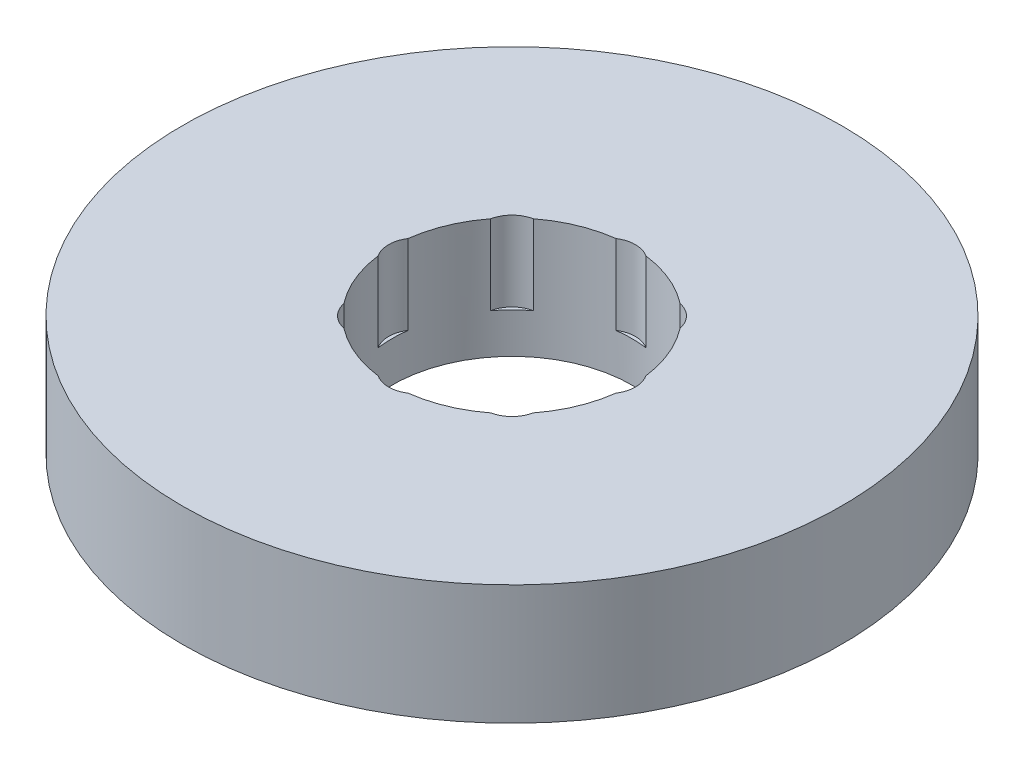
ISO-10303-21;
HEADER;
FILE_DESCRIPTION(('STEP AP214'),'2;1');
FILE_NAME('part.step','',(''),(''),'','','');
FILE_SCHEMA(('AUTOMOTIVE_DESIGN { 1 0 10303 214 1 1 1 1 }'));
ENDSEC;
DATA;
#1=APPLICATION_CONTEXT('core data for automotive mechanical design processes');
#2=APPLICATION_PROTOCOL_DEFINITION('international standard','automotive_design',2000,#1);
#3=PRODUCT_CONTEXT('',#1,'mechanical');
#4=PRODUCT('Part','Part','',(#3));
#5=PRODUCT_RELATED_PRODUCT_CATEGORY('part','',(#4));
#6=PRODUCT_DEFINITION_FORMATION('','',#4);
#7=PRODUCT_DEFINITION_CONTEXT('part definition',#1,'design');
#8=PRODUCT_DEFINITION('design','',#6,#7);
#9=PRODUCT_DEFINITION_SHAPE('','',#8);
#10=(LENGTH_UNIT() NAMED_UNIT(*) SI_UNIT(.MILLI.,.METRE.));
#11=(NAMED_UNIT(*) PLANE_ANGLE_UNIT() SI_UNIT($,.RADIAN.));
#12=(NAMED_UNIT(*) SI_UNIT($,.STERADIAN.) SOLID_ANGLE_UNIT());
#13=UNCERTAINTY_MEASURE_WITH_UNIT(LENGTH_MEASURE(1.E-05),#10,'distance_accuracy_value','');
#14=(GEOMETRIC_REPRESENTATION_CONTEXT(3) GLOBAL_UNCERTAINTY_ASSIGNED_CONTEXT((#13)) GLOBAL_UNIT_ASSIGNED_CONTEXT((#10,
#11,#12)) REPRESENTATION_CONTEXT('',''));
#15=CARTESIAN_POINT('',(0.,0.,0.));
#16=DIRECTION('',(0.,0.,1.));
#17=DIRECTION('',(1.,0.,0.));
#18=AXIS2_PLACEMENT_3D('',#15,#16,#17);
#19=CARTESIAN_POINT('',(0.,30.,0.));
#20=DIRECTION('',(0.,-1.,0.));
#21=DIRECTION('',(0.,0.,-1.));
#22=AXIS2_PLACEMENT_3D('',#19,#20,#21);
#23=CYLINDRICAL_SURFACE('',#22,82.5);
#24=CARTESIAN_POINT('',(0.,30.,0.));
#25=DIRECTION('',(0.,1.,0.));
#26=DIRECTION('',(0.,0.,1.));
#27=AXIS2_PLACEMENT_3D('',#24,#25,#26);
#28=CIRCLE('',#27,82.5);
#29=CARTESIAN_POINT('',(0.,30.,82.5));
#30=VERTEX_POINT('',#29);
#31=EDGE_CURVE('E183',#30,#30,#28,.T.);
#32=ORIENTED_EDGE('',*,*,#31,.F.);
#33=EDGE_LOOP('',(#32));
#34=FACE_BOUND('',#33,.T.);
#35=CARTESIAN_POINT('',(0.,0.,0.));
#36=DIRECTION('',(0.,1.,0.));
#37=DIRECTION('',(0.,0.,1.));
#38=AXIS2_PLACEMENT_3D('',#35,#36,#37);
#39=CIRCLE('',#38,82.5);
#40=CARTESIAN_POINT('',(0.,0.,82.5));
#41=VERTEX_POINT('',#40);
#42=EDGE_CURVE('E182',#41,#41,#39,.T.);
#43=ORIENTED_EDGE('',*,*,#42,.T.);
#44=EDGE_LOOP('',(#43));
#45=FACE_BOUND('',#44,.T.);
#46=ADVANCED_FACE('F39',(#34,#45),#23,.T.);
#47=CARTESIAN_POINT('',(0.,30.,0.));
#48=DIRECTION('',(0.,1.,0.));
#49=DIRECTION('',(0.,0.,1.));
#50=AXIS2_PLACEMENT_3D('',#47,#48,#49);
#51=PLANE('',#50);
#52=CARTESIAN_POINT('',(0.,30.,23.9976735900293));
#53=DIRECTION('',(0.,1.,0.));
#54=DIRECTION('',(1.,0.,0.));
#55=AXIS2_PLACEMENT_3D('',#52,#53,#54);
#56=CIRCLE('',#55,6.8860388837222);
#57=CARTESIAN_POINT('',(-3.7659098851479,30.,29.7626934724824));
#58=VERTEX_POINT('',#57);
#59=CARTESIAN_POINT('',(3.76590988514811,30.,29.7626934724824));
#60=VERTEX_POINT('',#59);
#61=EDGE_CURVE('E256',#58,#60,#56,.T.);
#62=ORIENTED_EDGE('',*,*,#61,.F.);
#63=CARTESIAN_POINT('',(0.,30.,0.));
#64=DIRECTION('',(0.,1.,0.));
#65=DIRECTION('',(0.,0.,1.));
#66=AXIS2_PLACEMENT_3D('',#63,#64,#65);
#67=CIRCLE('',#66,30.);
#68=CARTESIAN_POINT('',(-18.3825019636432,30.,23.7083027978945));
#69=VERTEX_POINT('',#68);
#70=EDGE_CURVE('E175',#69,#58,#67,.T.);
#71=ORIENTED_EDGE('',*,*,#70,.F.);
#72=CARTESIAN_POINT('',(-16.968917728211,30.,16.9689177282111));
#73=DIRECTION('',(0.,1.,0.));
#74=DIRECTION('',(0.707106781186549,0.,0.707106781186546));
#75=AXIS2_PLACEMENT_3D('',#72,#73,#74);
#76=CIRCLE('',#75,6.8860388837222);
#77=CARTESIAN_POINT('',(-23.7083027978945,30.,18.3825019636433));
#78=VERTEX_POINT('',#77);
#79=EDGE_CURVE('E152',#78,#69,#76,.T.);
#80=ORIENTED_EDGE('',*,*,#79,.F.);
#81=CARTESIAN_POINT('',(-29.7626934724824,30.,3.76590988514801));
#82=VERTEX_POINT('',#81);
#83=EDGE_CURVE('E168',#82,#78,#67,.T.);
#84=ORIENTED_EDGE('',*,*,#83,.F.);
#85=CARTESIAN_POINT('',(-23.9976735900293,30.,0.));
#86=DIRECTION('',(0.,1.,0.));
#87=DIRECTION('',(0.,0.,1.));
#88=AXIS2_PLACEMENT_3D('',#85,#86,#87);
#89=CIRCLE('',#88,6.8860388837222);
#90=CARTESIAN_POINT('',(-29.7626934724824,30.,-3.76590988514801));
#91=VERTEX_POINT('',#90);
#92=EDGE_CURVE('E205',#91,#82,#89,.T.);
#93=ORIENTED_EDGE('',*,*,#92,.F.);
#94=CARTESIAN_POINT('',(-23.7083027978947,30.,-18.382501963643));
#95=VERTEX_POINT('',#94);
#96=EDGE_CURVE('E181',#95,#91,#67,.T.);
#97=ORIENTED_EDGE('',*,*,#96,.F.);
#98=CARTESIAN_POINT('',(-16.9689177282113,30.,-16.9689177282109));
#99=DIRECTION('',(0.,1.,0.));
#100=DIRECTION('',(-0.707106781186539,0.,0.707106781186556));
#101=AXIS2_PLACEMENT_3D('',#98,#99,#100);
#102=CIRCLE('',#101,6.8860388837222);
#103=CARTESIAN_POINT('',(-18.3825019636436,30.,-23.7083027978943));
#104=VERTEX_POINT('',#103);
#105=EDGE_CURVE('E453',#104,#95,#102,.T.);
#106=ORIENTED_EDGE('',*,*,#105,.F.);
#107=CARTESIAN_POINT('',(-3.76590988514832,30.,-29.7626934724823));
#108=VERTEX_POINT('',#107);
#109=EDGE_CURVE('E189',#108,#104,#67,.T.);
#110=ORIENTED_EDGE('',*,*,#109,.F.);
#111=CARTESIAN_POINT('',(-2.51362288545708E-13,30.,-23.9976735900293));
#112=DIRECTION('',(0.,1.,0.));
#113=DIRECTION('',(-1.,0.,0.));
#114=AXIS2_PLACEMENT_3D('',#111,#112,#113);
#115=CIRCLE('',#114,6.8860388837222);
#116=CARTESIAN_POINT('',(3.76590988514769,30.,-29.7626934724824));
#117=VERTEX_POINT('',#116);
#118=EDGE_CURVE('E462',#117,#108,#115,.T.);
#119=ORIENTED_EDGE('',*,*,#118,.F.);
#120=CARTESIAN_POINT('',(18.3825019636431,30.,-23.7083027978946));
#121=VERTEX_POINT('',#120);
#122=EDGE_CURVE('E197',#121,#117,#67,.T.);
#123=ORIENTED_EDGE('',*,*,#122,.F.);
#124=CARTESIAN_POINT('',(16.9689177282109,30.,-16.9689177282112));
#125=DIRECTION('',(0.,1.,0.));
#126=DIRECTION('',(-0.707106781186554,0.,-0.707106781186541));
#127=AXIS2_PLACEMENT_3D('',#124,#125,#126);
#128=CIRCLE('',#127,6.8860388837222);
#129=CARTESIAN_POINT('',(23.7083027978943,30.,-18.3825019636435));
#130=VERTEX_POINT('',#129);
#131=EDGE_CURVE('E470',#130,#121,#128,.T.);
#132=ORIENTED_EDGE('',*,*,#131,.F.);
#133=CARTESIAN_POINT('',(29.7626934724824,30.,-3.76590988514801));
#134=VERTEX_POINT('',#133);
#135=EDGE_CURVE('E489',#134,#130,#67,.T.);
#136=ORIENTED_EDGE('',*,*,#135,.F.);
#137=CARTESIAN_POINT('',(23.9976735900293,30.,0.));
#138=DIRECTION('',(0.,1.,0.));
#139=DIRECTION('',(0.,0.,-1.));
#140=AXIS2_PLACEMENT_3D('',#137,#138,#139);
#141=CIRCLE('',#140,6.8860388837222);
#142=CARTESIAN_POINT('',(29.7626934724824,30.,3.76590988514801));
#143=VERTEX_POINT('',#142);
#144=EDGE_CURVE('E476',#143,#134,#141,.T.);
#145=ORIENTED_EDGE('',*,*,#144,.F.);
#146=CARTESIAN_POINT('',(23.7083027978946,30.,18.3825019636431));
#147=VERTEX_POINT('',#146);
#148=EDGE_CURVE('E491',#147,#143,#67,.T.);
#149=ORIENTED_EDGE('',*,*,#148,.F.);
#150=CARTESIAN_POINT('',(16.9689177282112,30.,16.968917728211));
#151=DIRECTION('',(0.,1.,0.));
#152=DIRECTION('',(0.707106781186544,0.,-0.707106781186551));
#153=AXIS2_PLACEMENT_3D('',#150,#151,#152);
#154=CIRCLE('',#153,6.8860388837222);
#155=CARTESIAN_POINT('',(18.3825019636434,30.,23.7083027978944));
#156=VERTEX_POINT('',#155);
#157=EDGE_CURVE('E475',#156,#147,#154,.T.);
#158=ORIENTED_EDGE('',*,*,#157,.F.);
#159=EDGE_CURVE('E190',#60,#156,#67,.T.);
#160=ORIENTED_EDGE('',*,*,#159,.F.);
#161=EDGE_LOOP('',(#62,#71,#80,#84,#93,#97,#106,#110,#119,#123,#132,#136,#145,#149,#158,#160));
#162=FACE_BOUND('',#161,.T.);
#163=ORIENTED_EDGE('',*,*,#31,.T.);
#164=EDGE_LOOP('',(#163));
#165=FACE_BOUND('',#164,.T.);
#166=ADVANCED_FACE('F170',(#162,#165),#51,.T.);
#167=CARTESIAN_POINT('',(0.,0.,0.));
#168=DIRECTION('',(0.,1.,0.));
#169=DIRECTION('',(0.,0.,1.));
#170=AXIS2_PLACEMENT_3D('',#167,#168,#169);
#171=PLANE('',#170);
#172=CARTESIAN_POINT('',(0.,0.,0.));
#173=DIRECTION('',(0.,1.,0.));
#174=DIRECTION('',(0.,0.,1.));
#175=AXIS2_PLACEMENT_3D('',#172,#173,#174);
#176=CIRCLE('',#175,30.);
#177=CARTESIAN_POINT('',(0.,0.,30.));
#178=VERTEX_POINT('',#177);
#179=EDGE_CURVE('E191',#178,#178,#176,.T.);
#180=ORIENTED_EDGE('',*,*,#179,.T.);
#181=EDGE_LOOP('',(#180));
#182=FACE_BOUND('',#181,.T.);
#183=ORIENTED_EDGE('',*,*,#42,.F.);
#184=EDGE_LOOP('',(#183));
#185=FACE_BOUND('',#184,.T.);
#186=ADVANCED_FACE('F277',(#182,#185),#171,.F.);
#187=CARTESIAN_POINT('',(0.,30.,0.));
#188=DIRECTION('',(0.,-1.,0.));
#189=DIRECTION('',(0.,0.,-1.));
#190=AXIS2_PLACEMENT_3D('',#187,#188,#189);
#191=CYLINDRICAL_SURFACE('',#190,30.);
#192=DIRECTION('',(0.,1.,0.));
#193=VECTOR('',#192,1.);
#194=CARTESIAN_POINT('',(-3.76590988514792,20.0420408060366,29.7626934724824));
#195=LINE('',#194,#193);
#196=CARTESIAN_POINT('',(-3.7659098851479,10.0840816120733,29.7626934724824));
#197=VERTEX_POINT('',#196);
#198=EDGE_CURVE('E11',#197,#58,#195,.T.);
#199=ORIENTED_EDGE('',*,*,#198,.F.);
#200=CARTESIAN_POINT('',(0.,10.0840816120733,0.));
#201=DIRECTION('',(0.,1.,0.));
#202=DIRECTION('',(0.,0.,1.));
#203=AXIS2_PLACEMENT_3D('',#200,#201,#202);
#204=CIRCLE('',#203,30.);
#205=CARTESIAN_POINT('',(3.76590988514811,10.0840816120733,29.7626934724824));
#206=VERTEX_POINT('',#205);
#207=EDGE_CURVE('E251',#197,#206,#204,.T.);
#208=ORIENTED_EDGE('',*,*,#207,.T.);
#209=DIRECTION('',(0.,1.,0.));
#210=VECTOR('',#209,1.);
#211=CARTESIAN_POINT('',(3.76590988514812,20.0420408060366,29.7626934724823));
#212=LINE('',#211,#210);
#213=EDGE_CURVE('E46',#60,#206,#212,.F.);
#214=ORIENTED_EDGE('',*,*,#213,.F.);
#215=ORIENTED_EDGE('',*,*,#159,.T.);
#216=DIRECTION('',(0.,1.,0.));
#217=VECTOR('',#216,1.);
#218=CARTESIAN_POINT('',(18.3825019636434,20.0420408060366,23.7083027978944));
#219=LINE('',#218,#217);
#220=CARTESIAN_POINT('',(18.3825019636434,10.0840816120733,23.7083027978944));
#221=VERTEX_POINT('',#220);
#222=EDGE_CURVE('E253',#221,#156,#219,.T.);
#223=ORIENTED_EDGE('',*,*,#222,.F.);
#224=CARTESIAN_POINT('',(0.,10.0840816120733,0.));
#225=DIRECTION('',(0.,1.,0.));
#226=DIRECTION('',(0.,0.,1.));
#227=AXIS2_PLACEMENT_3D('',#224,#225,#226);
#228=CIRCLE('',#227,30.);
#229=CARTESIAN_POINT('',(23.7083027978946,10.0840816120733,18.3825019636431));
#230=VERTEX_POINT('',#229);
#231=EDGE_CURVE('E246',#221,#230,#228,.T.);
#232=ORIENTED_EDGE('',*,*,#231,.T.);
#233=DIRECTION('',(0.,1.,0.));
#234=VECTOR('',#233,1.);
#235=CARTESIAN_POINT('',(23.7083027978946,20.0420408060366,18.3825019636431));
#236=LINE('',#235,#234);
#237=EDGE_CURVE('E248',#147,#230,#236,.F.);
#238=ORIENTED_EDGE('',*,*,#237,.F.);
#239=ORIENTED_EDGE('',*,*,#148,.T.);
#240=DIRECTION('',(0.,1.,0.));
#241=VECTOR('',#240,1.);
#242=CARTESIAN_POINT('',(29.7626934724824,20.0420408060366,3.76590988514802));
#243=LINE('',#242,#241);
#244=CARTESIAN_POINT('',(29.7626934724824,10.0840816120733,3.76590988514801));
#245=VERTEX_POINT('',#244);
#246=EDGE_CURVE('E243',#245,#143,#243,.T.);
#247=ORIENTED_EDGE('',*,*,#246,.F.);
#248=CARTESIAN_POINT('',(0.,10.0840816120733,0.));
#249=DIRECTION('',(0.,1.,0.));
#250=DIRECTION('',(0.,0.,1.));
#251=AXIS2_PLACEMENT_3D('',#248,#249,#250);
#252=CIRCLE('',#251,30.);
#253=CARTESIAN_POINT('',(29.7626934724824,10.0840816120733,-3.76590988514801));
#254=VERTEX_POINT('',#253);
#255=EDGE_CURVE('E236',#245,#254,#252,.T.);
#256=ORIENTED_EDGE('',*,*,#255,.T.);
#257=DIRECTION('',(0.,1.,0.));
#258=VECTOR('',#257,1.);
#259=CARTESIAN_POINT('',(29.7626934724824,20.0420408060366,-3.76590988514802));
#260=LINE('',#259,#258);
#261=EDGE_CURVE('E241',#134,#254,#260,.F.);
#262=ORIENTED_EDGE('',*,*,#261,.F.);
#263=ORIENTED_EDGE('',*,*,#135,.T.);
#264=DIRECTION('',(0.,1.,0.));
#265=VECTOR('',#264,1.);
#266=CARTESIAN_POINT('',(23.7083027978943,20.0420408060366,-18.3825019636435));
#267=LINE('',#266,#265);
#268=CARTESIAN_POINT('',(23.7083027978943,10.0840816120733,-18.3825019636435));
#269=VERTEX_POINT('',#268);
#270=EDGE_CURVE('E237',#269,#130,#267,.T.);
#271=ORIENTED_EDGE('',*,*,#270,.F.);
#272=CARTESIAN_POINT('',(0.,10.0840816120733,0.));
#273=DIRECTION('',(0.,1.,0.));
#274=DIRECTION('',(0.,0.,1.));
#275=AXIS2_PLACEMENT_3D('',#272,#273,#274);
#276=CIRCLE('',#275,30.);
#277=CARTESIAN_POINT('',(18.3825019636431,10.0840816120733,-23.7083027978946));
#278=VERTEX_POINT('',#277);
#279=EDGE_CURVE('E229',#269,#278,#276,.T.);
#280=ORIENTED_EDGE('',*,*,#279,.T.);
#281=DIRECTION('',(0.,1.,0.));
#282=VECTOR('',#281,1.);
#283=CARTESIAN_POINT('',(18.3825019636431,20.0420408060366,-23.7083027978946));
#284=LINE('',#283,#282);
#285=EDGE_CURVE('E232',#121,#278,#284,.F.);
#286=ORIENTED_EDGE('',*,*,#285,.F.);
#287=ORIENTED_EDGE('',*,*,#122,.T.);
#288=DIRECTION('',(0.,1.,0.));
#289=VECTOR('',#288,1.);
#290=CARTESIAN_POINT('',(3.76590988514771,20.0420408060366,-29.7626934724824));
#291=LINE('',#290,#289);
#292=CARTESIAN_POINT('',(3.76590988514769,10.0840816120733,-29.7626934724824));
#293=VERTEX_POINT('',#292);
#294=EDGE_CURVE('E227',#293,#117,#291,.T.);
#295=ORIENTED_EDGE('',*,*,#294,.F.);
#296=CARTESIAN_POINT('',(0.,10.0840816120733,0.));
#297=DIRECTION('',(0.,1.,0.));
#298=DIRECTION('',(0.,0.,1.));
#299=AXIS2_PLACEMENT_3D('',#296,#297,#298);
#300=CIRCLE('',#299,30.);
#301=CARTESIAN_POINT('',(-3.76590988514832,10.0840816120733,-29.7626934724823));
#302=VERTEX_POINT('',#301);
#303=EDGE_CURVE('E225',#293,#302,#300,.T.);
#304=ORIENTED_EDGE('',*,*,#303,.T.);
#305=DIRECTION('',(0.,1.,0.));
#306=VECTOR('',#305,1.);
#307=CARTESIAN_POINT('',(-3.76590988514833,20.0420408060366,-29.7626934724823));
#308=LINE('',#307,#306);
#309=EDGE_CURVE('E223',#108,#302,#308,.F.);
#310=ORIENTED_EDGE('',*,*,#309,.F.);
#311=ORIENTED_EDGE('',*,*,#109,.T.);
#312=DIRECTION('',(0.,1.,0.));
#313=VECTOR('',#312,1.);
#314=CARTESIAN_POINT('',(-18.3825019636435,20.0420408060366,-23.7083027978943));
#315=LINE('',#314,#313);
#316=CARTESIAN_POINT('',(-18.3825019636436,10.0840816120733,-23.7083027978943));
#317=VERTEX_POINT('',#316);
#318=EDGE_CURVE('E219',#317,#104,#315,.T.);
#319=ORIENTED_EDGE('',*,*,#318,.F.);
#320=CARTESIAN_POINT('',(0.,10.0840816120733,0.));
#321=DIRECTION('',(0.,1.,0.));
#322=DIRECTION('',(0.,0.,1.));
#323=AXIS2_PLACEMENT_3D('',#320,#321,#322);
#324=CIRCLE('',#323,30.);
#325=CARTESIAN_POINT('',(-23.7083027978947,10.0840816120733,-18.382501963643));
#326=VERTEX_POINT('',#325);
#327=EDGE_CURVE('E159',#317,#326,#324,.T.);
#328=ORIENTED_EDGE('',*,*,#327,.T.);
#329=DIRECTION('',(0.,1.,0.));
#330=VECTOR('',#329,1.);
#331=CARTESIAN_POINT('',(-23.7083027978947,20.0420408060366,-18.382501963643));
#332=LINE('',#331,#330);
#333=EDGE_CURVE('E220',#95,#326,#332,.F.);
#334=ORIENTED_EDGE('',*,*,#333,.F.);
#335=ORIENTED_EDGE('',*,*,#96,.T.);
#336=DIRECTION('',(0.,1.,0.));
#337=VECTOR('',#336,1.);
#338=CARTESIAN_POINT('',(-29.7626934724824,20.0420408060366,-3.76590988514802));
#339=LINE('',#338,#337);
#340=CARTESIAN_POINT('',(-29.7626934724824,10.0840816120733,-3.76590988514801));
#341=VERTEX_POINT('',#340);
#342=EDGE_CURVE('E209',#341,#91,#339,.T.);
#343=ORIENTED_EDGE('',*,*,#342,.F.);
#344=CARTESIAN_POINT('',(0.,10.0840816120733,0.));
#345=DIRECTION('',(0.,1.,0.));
#346=DIRECTION('',(0.,0.,1.));
#347=AXIS2_PLACEMENT_3D('',#344,#345,#346);
#348=CIRCLE('',#347,30.);
#349=CARTESIAN_POINT('',(-29.7626934724824,10.0840816120733,3.76590988514801));
#350=VERTEX_POINT('',#349);
#351=EDGE_CURVE('E206',#341,#350,#348,.T.);
#352=ORIENTED_EDGE('',*,*,#351,.T.);
#353=DIRECTION('',(0.,1.,0.));
#354=VECTOR('',#353,1.);
#355=CARTESIAN_POINT('',(-29.7626934724824,20.0420408060366,3.76590988514802));
#356=LINE('',#355,#354);
#357=EDGE_CURVE('E179',#82,#350,#356,.F.);
#358=ORIENTED_EDGE('',*,*,#357,.F.);
#359=ORIENTED_EDGE('',*,*,#83,.T.);
#360=DIRECTION('',(0.,1.,0.));
#361=VECTOR('',#360,1.);
#362=CARTESIAN_POINT('',(-23.7083027978945,20.0420408060366,18.3825019636433));
#363=LINE('',#362,#361);
#364=CARTESIAN_POINT('',(-23.7083027978945,10.0840816120733,18.3825019636433));
#365=VERTEX_POINT('',#364);
#366=EDGE_CURVE('E147',#365,#78,#363,.T.);
#367=ORIENTED_EDGE('',*,*,#366,.F.);
#368=CARTESIAN_POINT('',(0.,10.0840816120733,0.));
#369=DIRECTION('',(0.,1.,0.));
#370=DIRECTION('',(0.,0.,1.));
#371=AXIS2_PLACEMENT_3D('',#368,#369,#370);
#372=CIRCLE('',#371,30.);
#373=CARTESIAN_POINT('',(-18.3825019636432,10.0840816120733,23.7083027978945));
#374=VERTEX_POINT('',#373);
#375=EDGE_CURVE('E215',#365,#374,#372,.T.);
#376=ORIENTED_EDGE('',*,*,#375,.T.);
#377=DIRECTION('',(0.,1.,0.));
#378=VECTOR('',#377,1.);
#379=CARTESIAN_POINT('',(-18.3825019636432,20.0420408060366,23.7083027978945));
#380=LINE('',#379,#378);
#381=EDGE_CURVE('E161',#69,#374,#380,.F.);
#382=ORIENTED_EDGE('',*,*,#381,.F.);
#383=ORIENTED_EDGE('',*,*,#70,.T.);
#384=EDGE_LOOP('',(#199,#208,#214,#215,#223,#232,#238,#239,#247,#256,#262,#263,#271,#280,#286,
#287,#295,#304,#310,#311,#319,#328,#334,#335,#343,#352,#358,#359,#367,#376,#382,#383));
#385=FACE_BOUND('',#384,.T.);
#386=ORIENTED_EDGE('',*,*,#179,.F.);
#387=EDGE_LOOP('',(#386));
#388=FACE_BOUND('',#387,.T.);
#389=ADVANCED_FACE('F176',(#385,#388),#191,.F.);
#390=CARTESIAN_POINT('',(-23.9976735900293,10.0840816120733,0.));
#391=DIRECTION('',(0.,1.,0.));
#392=DIRECTION('',(0.,0.,1.));
#393=AXIS2_PLACEMENT_3D('',#390,#391,#392);
#394=CYLINDRICAL_SURFACE('',#393,6.8860388837222);
#395=ORIENTED_EDGE('',*,*,#342,.T.);
#396=ORIENTED_EDGE('',*,*,#92,.T.);
#397=ORIENTED_EDGE('',*,*,#357,.T.);
#398=CARTESIAN_POINT('',(-23.9976735900293,10.0840816120733,0.));
#399=DIRECTION('',(0.,1.,0.));
#400=DIRECTION('',(0.,0.,1.));
#401=AXIS2_PLACEMENT_3D('',#398,#399,#400);
#402=CIRCLE('',#401,6.8860388837222);
#403=EDGE_CURVE('E200',#341,#350,#402,.T.);
#404=ORIENTED_EDGE('',*,*,#403,.F.);
#405=EDGE_LOOP('',(#395,#396,#397,#404));
#406=FACE_BOUND('',#405,.T.);
#407=ADVANCED_FACE('F286',(#406),#394,.F.);
#408=CARTESIAN_POINT('',(-23.9976735900293,10.0840816120733,0.));
#409=DIRECTION('',(0.,1.,0.));
#410=DIRECTION('',(0.,0.,1.));
#411=AXIS2_PLACEMENT_3D('',#408,#409,#410);
#412=PLANE('',#411);
#413=ORIENTED_EDGE('',*,*,#403,.T.);
#414=ORIENTED_EDGE('',*,*,#351,.F.);
#415=EDGE_LOOP('',(#413,#414));
#416=FACE_BOUND('',#415,.T.);
#417=ADVANCED_FACE('F289',(#416),#412,.T.);
#418=CARTESIAN_POINT('',(-16.968917728211,10.0840816120733,16.9689177282111));
#419=DIRECTION('',(0.,1.,0.));
#420=DIRECTION('',(0.,0.,1.));
#421=AXIS2_PLACEMENT_3D('',#418,#419,#420);
#422=CYLINDRICAL_SURFACE('',#421,6.8860388837222);
#423=ORIENTED_EDGE('',*,*,#366,.T.);
#424=ORIENTED_EDGE('',*,*,#79,.T.);
#425=ORIENTED_EDGE('',*,*,#381,.T.);
#426=CARTESIAN_POINT('',(-16.968917728211,10.0840816120733,16.9689177282111));
#427=DIRECTION('',(0.,1.,0.));
#428=DIRECTION('',(0.707106781186549,0.,0.707106781186546));
#429=AXIS2_PLACEMENT_3D('',#426,#427,#428);
#430=CIRCLE('',#429,6.8860388837222);
#431=EDGE_CURVE('E156',#365,#374,#430,.T.);
#432=ORIENTED_EDGE('',*,*,#431,.F.);
#433=EDGE_LOOP('',(#423,#424,#425,#432));
#434=FACE_BOUND('',#433,.T.);
#435=ADVANCED_FACE('F155',(#434),#422,.F.);
#436=CARTESIAN_POINT('',(-16.968917728211,10.0840816120733,16.9689177282111));
#437=DIRECTION('',(0.,1.,0.));
#438=DIRECTION('',(0.707106781186549,0.,0.707106781186546));
#439=AXIS2_PLACEMENT_3D('',#436,#437,#438);
#440=PLANE('',#439);
#441=ORIENTED_EDGE('',*,*,#431,.T.);
#442=ORIENTED_EDGE('',*,*,#375,.F.);
#443=EDGE_LOOP('',(#441,#442));
#444=FACE_BOUND('',#443,.T.);
#445=ADVANCED_FACE('F300',(#444),#440,.T.);
#446=CARTESIAN_POINT('',(-16.9689177282113,10.0840816120733,-16.9689177282109));
#447=DIRECTION('',(0.,1.,0.));
#448=DIRECTION('',(0.,0.,1.));
#449=AXIS2_PLACEMENT_3D('',#446,#447,#448);
#450=CYLINDRICAL_SURFACE('',#449,6.8860388837222);
#451=ORIENTED_EDGE('',*,*,#318,.T.);
#452=ORIENTED_EDGE('',*,*,#105,.T.);
#453=ORIENTED_EDGE('',*,*,#333,.T.);
#454=CARTESIAN_POINT('',(-16.9689177282113,10.0840816120733,-16.9689177282109));
#455=DIRECTION('',(0.,1.,0.));
#456=DIRECTION('',(-0.707106781186539,0.,0.707106781186556));
#457=AXIS2_PLACEMENT_3D('',#454,#455,#456);
#458=CIRCLE('',#457,6.8860388837222);
#459=EDGE_CURVE('E454',#317,#326,#458,.T.);
#460=ORIENTED_EDGE('',*,*,#459,.F.);
#461=EDGE_LOOP('',(#451,#452,#453,#460));
#462=FACE_BOUND('',#461,.T.);
#463=ADVANCED_FACE('F299',(#462),#450,.F.);
#464=CARTESIAN_POINT('',(-16.9689177282113,10.0840816120733,-16.9689177282109));
#465=DIRECTION('',(0.,1.,0.));
#466=DIRECTION('',(-0.707106781186539,0.,0.707106781186556));
#467=AXIS2_PLACEMENT_3D('',#464,#465,#466);
#468=PLANE('',#467);
#469=ORIENTED_EDGE('',*,*,#459,.T.);
#470=ORIENTED_EDGE('',*,*,#327,.F.);
#471=EDGE_LOOP('',(#469,#470));
#472=FACE_BOUND('',#471,.T.);
#473=ADVANCED_FACE('F379',(#472),#468,.T.);
#474=CARTESIAN_POINT('',(-2.51362288545708E-13,10.0840816120733,-23.9976735900293));
#475=DIRECTION('',(0.,1.,0.));
#476=DIRECTION('',(0.,0.,1.));
#477=AXIS2_PLACEMENT_3D('',#474,#475,#476);
#478=CYLINDRICAL_SURFACE('',#477,6.8860388837222);
#479=ORIENTED_EDGE('',*,*,#294,.T.);
#480=ORIENTED_EDGE('',*,*,#118,.T.);
#481=ORIENTED_EDGE('',*,*,#309,.T.);
#482=CARTESIAN_POINT('',(-2.51362288545708E-13,10.0840816120733,-23.9976735900293));
#483=DIRECTION('',(0.,1.,0.));
#484=DIRECTION('',(-1.,0.,0.));
#485=AXIS2_PLACEMENT_3D('',#482,#483,#484);
#486=CIRCLE('',#485,6.8860388837222);
#487=EDGE_CURVE('E465',#293,#302,#486,.T.);
#488=ORIENTED_EDGE('',*,*,#487,.F.);
#489=EDGE_LOOP('',(#479,#480,#481,#488));
#490=FACE_BOUND('',#489,.T.);
#491=ADVANCED_FACE('F371',(#490),#478,.F.);
#492=CARTESIAN_POINT('',(-2.51362288545708E-13,10.0840816120733,-23.9976735900293));
#493=DIRECTION('',(0.,1.,0.));
#494=DIRECTION('',(-1.,0.,0.));
#495=AXIS2_PLACEMENT_3D('',#492,#493,#494);
#496=PLANE('',#495);
#497=ORIENTED_EDGE('',*,*,#487,.T.);
#498=ORIENTED_EDGE('',*,*,#303,.F.);
#499=EDGE_LOOP('',(#497,#498));
#500=FACE_BOUND('',#499,.T.);
#501=ADVANCED_FACE('F308',(#500),#496,.T.);
#502=CARTESIAN_POINT('',(16.9689177282109,10.0840816120733,-16.9689177282112));
#503=DIRECTION('',(0.,1.,0.));
#504=DIRECTION('',(0.,0.,1.));
#505=AXIS2_PLACEMENT_3D('',#502,#503,#504);
#506=CYLINDRICAL_SURFACE('',#505,6.8860388837222);
#507=ORIENTED_EDGE('',*,*,#270,.T.);
#508=ORIENTED_EDGE('',*,*,#131,.T.);
#509=ORIENTED_EDGE('',*,*,#285,.T.);
#510=CARTESIAN_POINT('',(16.9689177282109,10.0840816120733,-16.9689177282112));
#511=DIRECTION('',(0.,1.,0.));
#512=DIRECTION('',(-0.707106781186554,0.,-0.707106781186541));
#513=AXIS2_PLACEMENT_3D('',#510,#511,#512);
#514=CIRCLE('',#513,6.8860388837222);
#515=EDGE_CURVE('E477',#269,#278,#514,.T.);
#516=ORIENTED_EDGE('',*,*,#515,.F.);
#517=EDGE_LOOP('',(#507,#508,#509,#516));
#518=FACE_BOUND('',#517,.T.);
#519=ADVANCED_FACE('F305',(#518),#506,.F.);
#520=CARTESIAN_POINT('',(16.9689177282109,10.0840816120733,-16.9689177282112));
#521=DIRECTION('',(0.,1.,0.));
#522=DIRECTION('',(-0.707106781186554,0.,-0.707106781186541));
#523=AXIS2_PLACEMENT_3D('',#520,#521,#522);
#524=PLANE('',#523);
#525=ORIENTED_EDGE('',*,*,#515,.T.);
#526=ORIENTED_EDGE('',*,*,#279,.F.);
#527=EDGE_LOOP('',(#525,#526));
#528=FACE_BOUND('',#527,.T.);
#529=ADVANCED_FACE('F304',(#528),#524,.T.);
#530=CARTESIAN_POINT('',(23.9976735900293,10.0840816120733,0.));
#531=DIRECTION('',(0.,1.,0.));
#532=DIRECTION('',(0.,0.,1.));
#533=AXIS2_PLACEMENT_3D('',#530,#531,#532);
#534=CYLINDRICAL_SURFACE('',#533,6.8860388837222);
#535=ORIENTED_EDGE('',*,*,#246,.T.);
#536=ORIENTED_EDGE('',*,*,#144,.T.);
#537=ORIENTED_EDGE('',*,*,#261,.T.);
#538=CARTESIAN_POINT('',(23.9976735900293,10.0840816120733,0.));
#539=DIRECTION('',(0.,1.,0.));
#540=DIRECTION('',(0.,0.,-1.));
#541=AXIS2_PLACEMENT_3D('',#538,#539,#540);
#542=CIRCLE('',#541,6.8860388837222);
#543=EDGE_CURVE('E478',#245,#254,#542,.T.);
#544=ORIENTED_EDGE('',*,*,#543,.F.);
#545=EDGE_LOOP('',(#535,#536,#537,#544));
#546=FACE_BOUND('',#545,.T.);
#547=ADVANCED_FACE('F309',(#546),#534,.F.);
#548=CARTESIAN_POINT('',(23.9976735900293,10.0840816120733,0.));
#549=DIRECTION('',(0.,1.,0.));
#550=DIRECTION('',(0.,0.,-1.));
#551=AXIS2_PLACEMENT_3D('',#548,#549,#550);
#552=PLANE('',#551);
#553=ORIENTED_EDGE('',*,*,#543,.T.);
#554=ORIENTED_EDGE('',*,*,#255,.F.);
#555=EDGE_LOOP('',(#553,#554));
#556=FACE_BOUND('',#555,.T.);
#557=ADVANCED_FACE('F314',(#556),#552,.T.);
#558=CARTESIAN_POINT('',(16.9689177282112,10.0840816120733,16.968917728211));
#559=DIRECTION('',(0.,1.,0.));
#560=DIRECTION('',(0.,0.,1.));
#561=AXIS2_PLACEMENT_3D('',#558,#559,#560);
#562=CYLINDRICAL_SURFACE('',#561,6.8860388837222);
#563=ORIENTED_EDGE('',*,*,#222,.T.);
#564=ORIENTED_EDGE('',*,*,#157,.T.);
#565=ORIENTED_EDGE('',*,*,#237,.T.);
#566=CARTESIAN_POINT('',(16.9689177282112,10.0840816120733,16.968917728211));
#567=DIRECTION('',(0.,1.,0.));
#568=DIRECTION('',(0.707106781186544,0.,-0.707106781186551));
#569=AXIS2_PLACEMENT_3D('',#566,#567,#568);
#570=CIRCLE('',#569,6.8860388837222);
#571=EDGE_CURVE('E56',#221,#230,#570,.T.);
#572=ORIENTED_EDGE('',*,*,#571,.F.);
#573=EDGE_LOOP('',(#563,#564,#565,#572));
#574=FACE_BOUND('',#573,.T.);
#575=ADVANCED_FACE('F318',(#574),#562,.F.);
#576=CARTESIAN_POINT('',(16.9689177282112,10.0840816120733,16.968917728211));
#577=DIRECTION('',(0.,1.,0.));
#578=DIRECTION('',(0.707106781186544,0.,-0.707106781186551));
#579=AXIS2_PLACEMENT_3D('',#576,#577,#578);
#580=PLANE('',#579);
#581=ORIENTED_EDGE('',*,*,#571,.T.);
#582=ORIENTED_EDGE('',*,*,#231,.F.);
#583=EDGE_LOOP('',(#581,#582));
#584=FACE_BOUND('',#583,.T.);
#585=ADVANCED_FACE('F270',(#584),#580,.T.);
#586=CARTESIAN_POINT('',(0.,10.0840816120733,23.9976735900293));
#587=DIRECTION('',(0.,1.,0.));
#588=DIRECTION('',(0.,0.,1.));
#589=AXIS2_PLACEMENT_3D('',#586,#587,#588);
#590=CYLINDRICAL_SURFACE('',#589,6.8860388837222);
#591=ORIENTED_EDGE('',*,*,#198,.T.);
#592=ORIENTED_EDGE('',*,*,#61,.T.);
#593=ORIENTED_EDGE('',*,*,#213,.T.);
#594=CARTESIAN_POINT('',(0.,10.0840816120733,23.9976735900293));
#595=DIRECTION('',(0.,1.,0.));
#596=DIRECTION('',(1.,0.,0.));
#597=AXIS2_PLACEMENT_3D('',#594,#595,#596);
#598=CIRCLE('',#597,6.8860388837222);
#599=EDGE_CURVE('E55',#197,#206,#598,.T.);
#600=ORIENTED_EDGE('',*,*,#599,.F.);
#601=EDGE_LOOP('',(#591,#592,#593,#600));
#602=FACE_BOUND('',#601,.T.);
#603=ADVANCED_FACE('F260',(#602),#590,.F.);
#604=CARTESIAN_POINT('',(0.,10.0840816120733,23.9976735900293));
#605=DIRECTION('',(0.,1.,0.));
#606=DIRECTION('',(1.,0.,0.));
#607=AXIS2_PLACEMENT_3D('',#604,#605,#606);
#608=PLANE('',#607);
#609=ORIENTED_EDGE('',*,*,#599,.T.);
#610=ORIENTED_EDGE('',*,*,#207,.F.);
#611=EDGE_LOOP('',(#609,#610));
#612=FACE_BOUND('',#611,.T.);
#613=ADVANCED_FACE('F261',(#612),#608,.T.);
#614=CLOSED_SHELL('',(#46,#166,#186,#389,#407,#417,#435,#445,#463,#473,#491,#501,#519,#529,#547,
#557,#575,#585,#603,#613));
#615=MANIFOLD_SOLID_BREP('B2',#614);
#616=ADVANCED_BREP_SHAPE_REPRESENTATION('',(#18,#615),#14);
#617=SHAPE_DEFINITION_REPRESENTATION(#9,#616);
ENDSEC;
END-ISO-10303-21;
